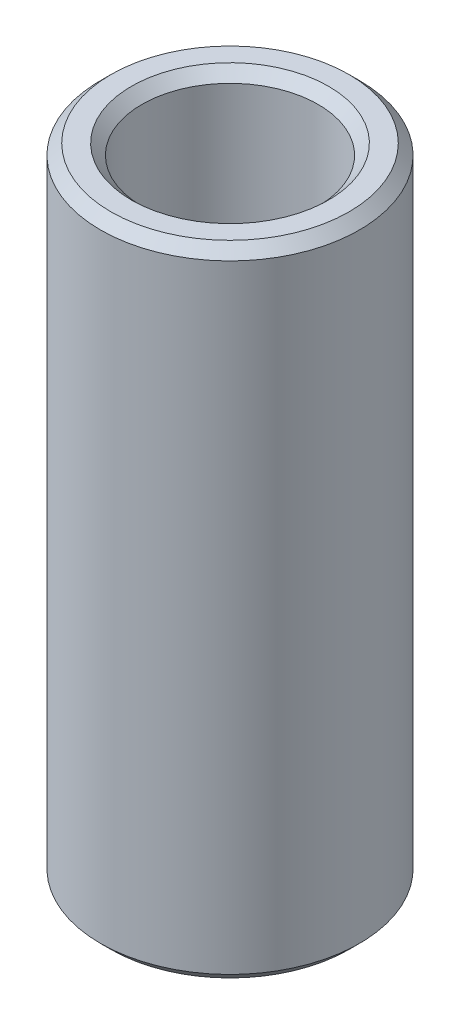
ISO-10303-21;
HEADER;
FILE_DESCRIPTION(('STEP AP214'),'2;1');
FILE_NAME('part.step','',(''),(''),'','','');
FILE_SCHEMA(('AUTOMOTIVE_DESIGN { 1 0 10303 214 1 1 1 1 }'));
ENDSEC;
DATA;
#1=APPLICATION_CONTEXT('core data for automotive mechanical design processes');
#2=APPLICATION_PROTOCOL_DEFINITION('international standard','automotive_design',2000,#1);
#3=PRODUCT_CONTEXT('',#1,'mechanical');
#4=PRODUCT('Part','Part','',(#3));
#5=PRODUCT_RELATED_PRODUCT_CATEGORY('part','',(#4));
#6=PRODUCT_DEFINITION_FORMATION('','',#4);
#7=PRODUCT_DEFINITION_CONTEXT('part definition',#1,'design');
#8=PRODUCT_DEFINITION('design','',#6,#7);
#9=PRODUCT_DEFINITION_SHAPE('','',#8);
#10=(LENGTH_UNIT() NAMED_UNIT(*) SI_UNIT(.MILLI.,.METRE.));
#11=(NAMED_UNIT(*) PLANE_ANGLE_UNIT() SI_UNIT($,.RADIAN.));
#12=(NAMED_UNIT(*) SI_UNIT($,.STERADIAN.) SOLID_ANGLE_UNIT());
#13=UNCERTAINTY_MEASURE_WITH_UNIT(LENGTH_MEASURE(1.E-05),#10,'distance_accuracy_value','');
#14=(GEOMETRIC_REPRESENTATION_CONTEXT(3) GLOBAL_UNCERTAINTY_ASSIGNED_CONTEXT((#13)) GLOBAL_UNIT_ASSIGNED_CONTEXT((#10,
#11,#12)) REPRESENTATION_CONTEXT('',''));
#15=CARTESIAN_POINT('',(0.,0.,0.));
#16=DIRECTION('',(0.,0.,1.));
#17=DIRECTION('',(1.,0.,0.));
#18=AXIS2_PLACEMENT_3D('',#15,#16,#17);
#19=CARTESIAN_POINT('',(0.,148.031641057411,0.));
#20=DIRECTION('',(0.,-1.,0.));
#21=DIRECTION('',(0.,0.,-1.));
#22=AXIS2_PLACEMENT_3D('',#19,#20,#21);
#23=CYLINDRICAL_SURFACE('',#22,30.);
#24=CARTESIAN_POINT('',(0.,2.42274646141658,0.));
#25=DIRECTION('',(0.,1.,0.));
#26=DIRECTION('',(0.,0.,1.));
#27=AXIS2_PLACEMENT_3D('',#24,#25,#26);
#28=CIRCLE('',#27,30.);
#29=CARTESIAN_POINT('',(0.,2.42274646141658,30.));
#30=VERTEX_POINT('',#29);
#31=EDGE_CURVE('E10',#30,#30,#28,.T.);
#32=ORIENTED_EDGE('',*,*,#31,.T.);
#33=EDGE_LOOP('',(#32));
#34=FACE_BOUND('',#33,.T.);
#35=CARTESIAN_POINT('',(0.,145.608894595994,0.));
#36=DIRECTION('',(0.,1.,0.));
#37=DIRECTION('',(0.,0.,1.));
#38=AXIS2_PLACEMENT_3D('',#35,#36,#37);
#39=CIRCLE('',#38,30.);
#40=CARTESIAN_POINT('',(0.,145.608894595994,30.));
#41=VERTEX_POINT('',#40);
#42=EDGE_CURVE('E50',#41,#41,#39,.F.);
#43=ORIENTED_EDGE('',*,*,#42,.T.);
#44=EDGE_LOOP('',(#43));
#45=FACE_BOUND('',#44,.T.);
#46=ADVANCED_FACE('F39',(#34,#45),#23,.T.);
#47=CARTESIAN_POINT('',(0.,148.031641057411,0.));
#48=DIRECTION('',(0.,1.,0.));
#49=DIRECTION('',(0.,0.,1.));
#50=AXIS2_PLACEMENT_3D('',#47,#48,#49);
#51=PLANE('',#50);
#52=CARTESIAN_POINT('',(0.,148.031641057411,0.));
#53=DIRECTION('',(0.,1.,0.));
#54=DIRECTION('',(0.,0.,1.));
#55=AXIS2_PLACEMENT_3D('',#52,#53,#54);
#56=CIRCLE('',#55,22.8442233785165);
#57=CARTESIAN_POINT('',(0.,148.031641057411,22.8442233785165));
#58=VERTEX_POINT('',#57);
#59=EDGE_CURVE('E58',#58,#58,#56,.F.);
#60=ORIENTED_EDGE('',*,*,#59,.T.);
#61=EDGE_LOOP('',(#60));
#62=FACE_BOUND('',#61,.T.);
#63=CARTESIAN_POINT('',(0.,148.031641057411,0.));
#64=DIRECTION('',(0.,1.,0.));
#65=DIRECTION('',(0.,0.,1.));
#66=AXIS2_PLACEMENT_3D('',#63,#64,#65);
#67=CIRCLE('',#66,27.5772535385834);
#68=CARTESIAN_POINT('',(0.,148.031641057411,27.5772535385834));
#69=VERTEX_POINT('',#68);
#70=EDGE_CURVE('E61',#69,#69,#67,.T.);
#71=ORIENTED_EDGE('',*,*,#70,.T.);
#72=EDGE_LOOP('',(#71));
#73=FACE_BOUND('',#72,.T.);
#74=ADVANCED_FACE('F88',(#62,#73),#51,.T.);
#75=CARTESIAN_POINT('',(0.,0.,0.));
#76=DIRECTION('',(0.,1.,0.));
#77=DIRECTION('',(0.,0.,1.));
#78=AXIS2_PLACEMENT_3D('',#75,#76,#77);
#79=PLANE('',#78);
#80=CARTESIAN_POINT('',(0.,0.,0.));
#81=DIRECTION('',(0.,1.,0.));
#82=DIRECTION('',(0.,0.,1.));
#83=AXIS2_PLACEMENT_3D('',#80,#81,#82);
#84=CIRCLE('',#83,22.8442233785165);
#85=CARTESIAN_POINT('',(0.,0.,22.8442233785165));
#86=VERTEX_POINT('',#85);
#87=EDGE_CURVE('E51',#86,#86,#84,.T.);
#88=ORIENTED_EDGE('',*,*,#87,.T.);
#89=EDGE_LOOP('',(#88));
#90=FACE_BOUND('',#89,.T.);
#91=CARTESIAN_POINT('',(0.,0.,0.));
#92=DIRECTION('',(0.,1.,0.));
#93=DIRECTION('',(0.,0.,1.));
#94=AXIS2_PLACEMENT_3D('',#91,#92,#93);
#95=CIRCLE('',#94,27.5772535385834);
#96=CARTESIAN_POINT('',(0.,0.,27.5772535385834));
#97=VERTEX_POINT('',#96);
#98=EDGE_CURVE('E54',#97,#97,#95,.F.);
#99=ORIENTED_EDGE('',*,*,#98,.T.);
#100=EDGE_LOOP('',(#99));
#101=FACE_BOUND('',#100,.T.);
#102=ADVANCED_FACE('F83',(#90,#101),#79,.F.);
#103=CARTESIAN_POINT('',(0.,148.031641057411,0.));
#104=DIRECTION('',(0.,-1.,0.));
#105=DIRECTION('',(0.,0.,-1.));
#106=AXIS2_PLACEMENT_3D('',#103,#104,#105);
#107=CYLINDRICAL_SURFACE('',#106,20.4214769170999);
#108=CARTESIAN_POINT('',(0.,145.608894595994,0.));
#109=DIRECTION('',(0.,1.,0.));
#110=DIRECTION('',(0.,0.,1.));
#111=AXIS2_PLACEMENT_3D('',#108,#109,#110);
#112=CIRCLE('',#111,20.4214769170999);
#113=CARTESIAN_POINT('',(0.,145.608894595994,20.4214769170999));
#114=VERTEX_POINT('',#113);
#115=EDGE_CURVE('E67',#114,#114,#112,.T.);
#116=ORIENTED_EDGE('',*,*,#115,.T.);
#117=EDGE_LOOP('',(#116));
#118=FACE_BOUND('',#117,.T.);
#119=CARTESIAN_POINT('',(0.,2.4227464614166,0.));
#120=DIRECTION('',(0.,1.,0.));
#121=DIRECTION('',(0.,0.,1.));
#122=AXIS2_PLACEMENT_3D('',#119,#120,#121);
#123=CIRCLE('',#122,20.4214769170999);
#124=CARTESIAN_POINT('',(0.,2.4227464614166,20.4214769170999));
#125=VERTEX_POINT('',#124);
#126=EDGE_CURVE('E69',#125,#125,#123,.F.);
#127=ORIENTED_EDGE('',*,*,#126,.T.);
#128=EDGE_LOOP('',(#127));
#129=FACE_BOUND('',#128,.T.);
#130=ADVANCED_FACE('F71',(#118,#129),#107,.F.);
#131=CARTESIAN_POINT('',(0.,145.608894595994,0.));
#132=DIRECTION('',(0.,1.,0.));
#133=DIRECTION('',(0.,0.,1.));
#134=AXIS2_PLACEMENT_3D('',#131,#132,#133);
#135=CONICAL_SURFACE('',#134,20.4214769170999,0.785398163397448);
#136=ORIENTED_EDGE('',*,*,#59,.F.);
#137=EDGE_LOOP('',(#136));
#138=FACE_BOUND('',#137,.T.);
#139=ORIENTED_EDGE('',*,*,#115,.F.);
#140=EDGE_LOOP('',(#139));
#141=FACE_BOUND('',#140,.T.);
#142=ADVANCED_FACE('F77',(#138,#141),#135,.F.);
#143=CARTESIAN_POINT('',(0.,0.,0.));
#144=DIRECTION('',(0.,-1.,0.));
#145=DIRECTION('',(0.,0.,-1.));
#146=AXIS2_PLACEMENT_3D('',#143,#144,#145);
#147=CONICAL_SURFACE('',#146,22.8442233785165,0.785398163397446);
#148=ORIENTED_EDGE('',*,*,#126,.F.);
#149=EDGE_LOOP('',(#148));
#150=FACE_BOUND('',#149,.T.);
#151=ORIENTED_EDGE('',*,*,#87,.F.);
#152=EDGE_LOOP('',(#151));
#153=FACE_BOUND('',#152,.T.);
#154=ADVANCED_FACE('F73',(#150,#153),#147,.F.);
#155=CARTESIAN_POINT('',(0.,2.42274646141658,0.));
#156=DIRECTION('',(0.,1.,0.));
#157=DIRECTION('',(0.,0.,1.));
#158=AXIS2_PLACEMENT_3D('',#155,#156,#157);
#159=CONICAL_SURFACE('',#158,30.,0.785398163397454);
#160=ORIENTED_EDGE('',*,*,#98,.F.);
#161=EDGE_LOOP('',(#160));
#162=FACE_BOUND('',#161,.T.);
#163=ORIENTED_EDGE('',*,*,#31,.F.);
#164=EDGE_LOOP('',(#163));
#165=FACE_BOUND('',#164,.T.);
#166=ADVANCED_FACE('F76',(#162,#165),#159,.T.);
#167=CARTESIAN_POINT('',(0.,148.031641057411,0.));
#168=DIRECTION('',(0.,-1.,0.));
#169=DIRECTION('',(0.,0.,-1.));
#170=AXIS2_PLACEMENT_3D('',#167,#168,#169);
#171=CONICAL_SURFACE('',#170,27.5772535385834,0.785398163397443);
#172=ORIENTED_EDGE('',*,*,#42,.F.);
#173=EDGE_LOOP('',(#172));
#174=FACE_BOUND('',#173,.T.);
#175=ORIENTED_EDGE('',*,*,#70,.F.);
#176=EDGE_LOOP('',(#175));
#177=FACE_BOUND('',#176,.T.);
#178=ADVANCED_FACE('F45',(#174,#177),#171,.T.);
#179=CLOSED_SHELL('',(#46,#74,#102,#130,#142,#154,#166,#178));
#180=MANIFOLD_SOLID_BREP('B2',#179);
#181=ADVANCED_BREP_SHAPE_REPRESENTATION('',(#18,#180),#14);
#182=SHAPE_DEFINITION_REPRESENTATION(#9,#181);
ENDSEC;
END-ISO-10303-21;
